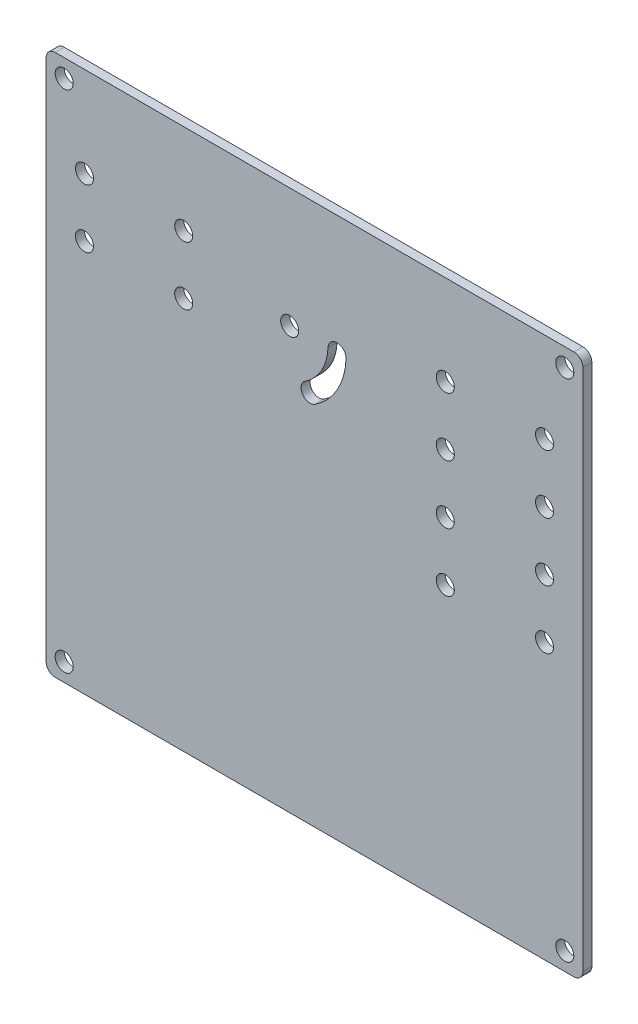
ISO-10303-21;
HEADER;
FILE_DESCRIPTION(('STEP AP214'),'2;1');
FILE_NAME('part.step','',(''),(''),'','','');
FILE_SCHEMA(('AUTOMOTIVE_DESIGN { 1 0 10303 214 1 1 1 1 }'));
ENDSEC;
DATA;
#1=APPLICATION_CONTEXT('core data for automotive mechanical design processes');
#2=APPLICATION_PROTOCOL_DEFINITION('international standard','automotive_design',2000,#1);
#3=PRODUCT_CONTEXT('',#1,'mechanical');
#4=PRODUCT('Part','Part','',(#3));
#5=PRODUCT_RELATED_PRODUCT_CATEGORY('part','',(#4));
#6=PRODUCT_DEFINITION_FORMATION('','',#4);
#7=PRODUCT_DEFINITION_CONTEXT('part definition',#1,'design');
#8=PRODUCT_DEFINITION('design','',#6,#7);
#9=PRODUCT_DEFINITION_SHAPE('','',#8);
#10=(LENGTH_UNIT() NAMED_UNIT(*) SI_UNIT(.MILLI.,.METRE.));
#11=(NAMED_UNIT(*) PLANE_ANGLE_UNIT() SI_UNIT($,.RADIAN.));
#12=(NAMED_UNIT(*) SI_UNIT($,.STERADIAN.) SOLID_ANGLE_UNIT());
#13=UNCERTAINTY_MEASURE_WITH_UNIT(LENGTH_MEASURE(1.E-05),#10,'distance_accuracy_value','');
#14=(GEOMETRIC_REPRESENTATION_CONTEXT(3) GLOBAL_UNCERTAINTY_ASSIGNED_CONTEXT((#13)) GLOBAL_UNIT_ASSIGNED_CONTEXT((#10,
#11,#12)) REPRESENTATION_CONTEXT('',''));
#15=CARTESIAN_POINT('',(0.,0.,0.));
#16=DIRECTION('',(0.,0.,1.));
#17=DIRECTION('',(1.,0.,0.));
#18=AXIS2_PLACEMENT_3D('',#15,#16,#17);
#19=CARTESIAN_POINT('',(0.,0.,2.));
#20=DIRECTION('',(0.,0.,-1.));
#21=DIRECTION('',(-1.,0.,0.));
#22=AXIS2_PLACEMENT_3D('',#19,#20,#21);
#23=PLANE('',#22);
#24=CARTESIAN_POINT('',(4.,116.,2.));
#25=DIRECTION('',(0.,0.,1.));
#26=DIRECTION('',(1.,0.,0.));
#27=AXIS2_PLACEMENT_3D('',#24,#25,#26);
#28=CIRCLE('',#27,2.);
#29=CARTESIAN_POINT('',(6.,116.,2.));
#30=VERTEX_POINT('',#29);
#31=EDGE_CURVE('E756',#30,#30,#28,.T.);
#32=ORIENTED_EDGE('',*,*,#31,.F.);
#33=EDGE_LOOP('',(#32));
#34=FACE_BOUND('',#33,.T.);
#35=CARTESIAN_POINT('',(115.,4.,2.));
#36=DIRECTION('',(0.,0.,1.));
#37=DIRECTION('',(1.,0.,0.));
#38=AXIS2_PLACEMENT_3D('',#35,#36,#37);
#39=CIRCLE('',#38,2.);
#40=CARTESIAN_POINT('',(117.,4.,2.));
#41=VERTEX_POINT('',#40);
#42=EDGE_CURVE('E760',#41,#41,#39,.T.);
#43=ORIENTED_EDGE('',*,*,#42,.F.);
#44=EDGE_LOOP('',(#43));
#45=FACE_BOUND('',#44,.T.);
#46=CARTESIAN_POINT('',(4.00000000000001,4.,2.));
#47=DIRECTION('',(0.,0.,1.));
#48=DIRECTION('',(1.,0.,0.));
#49=AXIS2_PLACEMENT_3D('',#46,#47,#48);
#50=CIRCLE('',#49,2.);
#51=CARTESIAN_POINT('',(6.00000000000001,4.,2.));
#52=VERTEX_POINT('',#51);
#53=EDGE_CURVE('E774',#52,#52,#50,.T.);
#54=ORIENTED_EDGE('',*,*,#53,.F.);
#55=EDGE_LOOP('',(#54));
#56=FACE_BOUND('',#55,.T.);
#57=CARTESIAN_POINT('',(115.,116.,2.));
#58=DIRECTION('',(0.,0.,1.));
#59=DIRECTION('',(1.,0.,0.));
#60=AXIS2_PLACEMENT_3D('',#57,#58,#59);
#61=CIRCLE('',#60,2.);
#62=CARTESIAN_POINT('',(117.,116.,2.));
#63=VERTEX_POINT('',#62);
#64=EDGE_CURVE('E766',#63,#63,#61,.T.);
#65=ORIENTED_EDGE('',*,*,#64,.F.);
#66=EDGE_LOOP('',(#65));
#67=FACE_BOUND('',#66,.T.);
#68=DIRECTION('',(0.,1.,0.));
#69=VECTOR('',#68,1.);
#70=CARTESIAN_POINT('',(119.,0.,2.));
#71=LINE('',#70,#69);
#72=CARTESIAN_POINT('',(119.,2.,2.));
#73=VERTEX_POINT('',#72);
#74=CARTESIAN_POINT('',(119.,118.,2.));
#75=VERTEX_POINT('',#74);
#76=EDGE_CURVE('E299',#73,#75,#71,.T.);
#77=ORIENTED_EDGE('',*,*,#76,.T.);
#78=CARTESIAN_POINT('',(117.,118.,2.));
#79=DIRECTION('',(0.,0.,-1.));
#80=DIRECTION('',(-1.,0.,0.));
#81=AXIS2_PLACEMENT_3D('',#78,#79,#80);
#82=CIRCLE('',#81,2.);
#83=CARTESIAN_POINT('',(117.,120.,2.));
#84=VERTEX_POINT('',#83);
#85=EDGE_CURVE('E353',#75,#84,#82,.F.);
#86=ORIENTED_EDGE('',*,*,#85,.T.);
#87=DIRECTION('',(1.,0.,0.));
#88=VECTOR('',#87,1.);
#89=CARTESIAN_POINT('',(0.,120.,2.));
#90=LINE('',#89,#88);
#91=CARTESIAN_POINT('',(2.,120.,2.));
#92=VERTEX_POINT('',#91);
#93=EDGE_CURVE('E294',#92,#84,#90,.T.);
#94=ORIENTED_EDGE('',*,*,#93,.F.);
#95=CARTESIAN_POINT('',(2.,118.,2.));
#96=DIRECTION('',(0.,0.,-1.));
#97=DIRECTION('',(-1.,0.,0.));
#98=AXIS2_PLACEMENT_3D('',#95,#96,#97);
#99=CIRCLE('',#98,2.);
#100=CARTESIAN_POINT('',(0.,118.,2.));
#101=VERTEX_POINT('',#100);
#102=EDGE_CURVE('E345',#92,#101,#99,.F.);
#103=ORIENTED_EDGE('',*,*,#102,.T.);
#104=DIRECTION('',(0.,1.,0.));
#105=VECTOR('',#104,1.);
#106=CARTESIAN_POINT('',(0.,0.,2.));
#107=LINE('',#106,#105);
#108=CARTESIAN_POINT('',(0.,2.,2.));
#109=VERTEX_POINT('',#108);
#110=EDGE_CURVE('E290',#109,#101,#107,.T.);
#111=ORIENTED_EDGE('',*,*,#110,.F.);
#112=CARTESIAN_POINT('',(2.,2.,2.));
#113=DIRECTION('',(0.,0.,-1.));
#114=DIRECTION('',(-1.,0.,0.));
#115=AXIS2_PLACEMENT_3D('',#112,#113,#114);
#116=CIRCLE('',#115,2.);
#117=CARTESIAN_POINT('',(2.,0.,2.));
#118=VERTEX_POINT('',#117);
#119=EDGE_CURVE('E62',#109,#118,#116,.F.);
#120=ORIENTED_EDGE('',*,*,#119,.T.);
#121=DIRECTION('',(1.,0.,0.));
#122=VECTOR('',#121,1.);
#123=CARTESIAN_POINT('',(0.,0.,2.));
#124=LINE('',#123,#122);
#125=CARTESIAN_POINT('',(117.,0.,2.));
#126=VERTEX_POINT('',#125);
#127=EDGE_CURVE('E303',#118,#126,#124,.T.);
#128=ORIENTED_EDGE('',*,*,#127,.T.);
#129=CARTESIAN_POINT('',(117.,2.,2.));
#130=DIRECTION('',(0.,0.,-1.));
#131=DIRECTION('',(-1.,0.,0.));
#132=AXIS2_PLACEMENT_3D('',#129,#130,#131);
#133=CIRCLE('',#132,2.);
#134=EDGE_CURVE('E350',#126,#73,#133,.F.);
#135=ORIENTED_EDGE('',*,*,#134,.T.);
#136=EDGE_LOOP('',(#77,#86,#94,#103,#111,#120,#128,#135));
#137=FACE_BOUND('',#136,.T.);
#138=CARTESIAN_POINT('',(8.5,100.,2.));
#139=DIRECTION('',(0.,0.,1.));
#140=DIRECTION('',(1.,0.,0.));
#141=AXIS2_PLACEMENT_3D('',#138,#139,#140);
#142=CIRCLE('',#141,2.);
#143=CARTESIAN_POINT('',(10.5,100.,2.));
#144=VERTEX_POINT('',#143);
#145=EDGE_CURVE('E282',#144,#144,#142,.T.);
#146=ORIENTED_EDGE('',*,*,#145,.F.);
#147=EDGE_LOOP('',(#146));
#148=FACE_BOUND('',#147,.T.);
#149=CARTESIAN_POINT('',(54.,93.5,2.));
#150=DIRECTION('',(0.,0.,1.));
#151=DIRECTION('',(1.,0.,0.));
#152=AXIS2_PLACEMENT_3D('',#149,#150,#151);
#153=CIRCLE('',#152,2.);
#154=CARTESIAN_POINT('',(56.,93.5,2.));
#155=VERTEX_POINT('',#154);
#156=EDGE_CURVE('E195',#155,#155,#153,.T.);
#157=ORIENTED_EDGE('',*,*,#156,.F.);
#158=EDGE_LOOP('',(#157));
#159=FACE_BOUND('',#158,.T.);
#160=CARTESIAN_POINT('',(30.5,87.,2.));
#161=DIRECTION('',(0.,0.,1.));
#162=DIRECTION('',(1.,0.,0.));
#163=AXIS2_PLACEMENT_3D('',#160,#161,#162);
#164=CIRCLE('',#163,2.);
#165=CARTESIAN_POINT('',(32.5,87.,2.));
#166=VERTEX_POINT('',#165);
#167=EDGE_CURVE('E186',#166,#166,#164,.T.);
#168=ORIENTED_EDGE('',*,*,#167,.F.);
#169=EDGE_LOOP('',(#168));
#170=FACE_BOUND('',#169,.T.);
#171=CARTESIAN_POINT('',(8.5,87.,2.));
#172=DIRECTION('',(0.,0.,1.));
#173=DIRECTION('',(1.,0.,0.));
#174=AXIS2_PLACEMENT_3D('',#171,#172,#173);
#175=CIRCLE('',#174,2.);
#176=CARTESIAN_POINT('',(10.5,87.,2.));
#177=VERTEX_POINT('',#176);
#178=EDGE_CURVE('E213',#177,#177,#175,.T.);
#179=ORIENTED_EDGE('',*,*,#178,.F.);
#180=EDGE_LOOP('',(#179));
#181=FACE_BOUND('',#180,.T.);
#182=CARTESIAN_POINT('',(30.5,100.,2.));
#183=DIRECTION('',(0.,0.,1.));
#184=DIRECTION('',(1.,0.,0.));
#185=AXIS2_PLACEMENT_3D('',#182,#183,#184);
#186=CIRCLE('',#185,2.);
#187=CARTESIAN_POINT('',(32.5,100.,2.));
#188=VERTEX_POINT('',#187);
#189=EDGE_CURVE('E204',#188,#188,#186,.T.);
#190=ORIENTED_EDGE('',*,*,#189,.F.);
#191=EDGE_LOOP('',(#190));
#192=FACE_BOUND('',#191,.T.);
#193=CARTESIAN_POINT('',(88.5,100.,2.));
#194=DIRECTION('',(0.,0.,1.));
#195=DIRECTION('',(1.,0.,0.));
#196=AXIS2_PLACEMENT_3D('',#193,#194,#195);
#197=CIRCLE('',#196,2.);
#198=CARTESIAN_POINT('',(90.5,100.,2.));
#199=VERTEX_POINT('',#198);
#200=EDGE_CURVE('E203',#199,#199,#197,.T.);
#201=ORIENTED_EDGE('',*,*,#200,.F.);
#202=EDGE_LOOP('',(#201));
#203=FACE_BOUND('',#202,.T.);
#204=CARTESIAN_POINT('',(88.5,87.,2.));
#205=DIRECTION('',(0.,0.,1.));
#206=DIRECTION('',(1.,0.,0.));
#207=AXIS2_PLACEMENT_3D('',#204,#205,#206);
#208=CIRCLE('',#207,2.);
#209=CARTESIAN_POINT('',(90.5,87.,2.));
#210=VERTEX_POINT('',#209);
#211=EDGE_CURVE('E227',#210,#210,#208,.T.);
#212=ORIENTED_EDGE('',*,*,#211,.F.);
#213=EDGE_LOOP('',(#212));
#214=FACE_BOUND('',#213,.T.);
#215=CARTESIAN_POINT('',(110.5,100.,2.));
#216=DIRECTION('',(0.,0.,1.));
#217=DIRECTION('',(1.,0.,0.));
#218=AXIS2_PLACEMENT_3D('',#215,#216,#217);
#219=CIRCLE('',#218,2.);
#220=CARTESIAN_POINT('',(112.5,100.,2.));
#221=VERTEX_POINT('',#220);
#222=EDGE_CURVE('E235',#221,#221,#219,.T.);
#223=ORIENTED_EDGE('',*,*,#222,.F.);
#224=EDGE_LOOP('',(#223));
#225=FACE_BOUND('',#224,.T.);
#226=CARTESIAN_POINT('',(110.5,87.,2.));
#227=DIRECTION('',(0.,0.,1.));
#228=DIRECTION('',(1.,0.,0.));
#229=AXIS2_PLACEMENT_3D('',#226,#227,#228);
#230=CIRCLE('',#229,2.);
#231=CARTESIAN_POINT('',(112.5,87.,2.));
#232=VERTEX_POINT('',#231);
#233=EDGE_CURVE('E243',#232,#232,#230,.T.);
#234=ORIENTED_EDGE('',*,*,#233,.F.);
#235=EDGE_LOOP('',(#234));
#236=FACE_BOUND('',#235,.T.);
#237=CARTESIAN_POINT('',(88.5,74.,2.));
#238=DIRECTION('',(0.,0.,1.));
#239=DIRECTION('',(1.,0.,0.));
#240=AXIS2_PLACEMENT_3D('',#237,#238,#239);
#241=CIRCLE('',#240,2.);
#242=CARTESIAN_POINT('',(90.5,74.,2.));
#243=VERTEX_POINT('',#242);
#244=EDGE_CURVE('E251',#243,#243,#241,.T.);
#245=ORIENTED_EDGE('',*,*,#244,.F.);
#246=EDGE_LOOP('',(#245));
#247=FACE_BOUND('',#246,.T.);
#248=CARTESIAN_POINT('',(88.5,61.,2.));
#249=DIRECTION('',(0.,0.,1.));
#250=DIRECTION('',(1.,0.,0.));
#251=AXIS2_PLACEMENT_3D('',#248,#249,#250);
#252=CIRCLE('',#251,2.);
#253=CARTESIAN_POINT('',(90.5,61.,2.));
#254=VERTEX_POINT('',#253);
#255=EDGE_CURVE('E259',#254,#254,#252,.T.);
#256=ORIENTED_EDGE('',*,*,#255,.F.);
#257=EDGE_LOOP('',(#256));
#258=FACE_BOUND('',#257,.T.);
#259=CARTESIAN_POINT('',(110.5,74.,2.));
#260=DIRECTION('',(0.,0.,1.));
#261=DIRECTION('',(1.,0.,0.));
#262=AXIS2_PLACEMENT_3D('',#259,#260,#261);
#263=CIRCLE('',#262,2.);
#264=CARTESIAN_POINT('',(112.5,74.,2.));
#265=VERTEX_POINT('',#264);
#266=EDGE_CURVE('E267',#265,#265,#263,.T.);
#267=ORIENTED_EDGE('',*,*,#266,.F.);
#268=EDGE_LOOP('',(#267));
#269=FACE_BOUND('',#268,.T.);
#270=CARTESIAN_POINT('',(110.5,61.,2.));
#271=DIRECTION('',(0.,0.,1.));
#272=DIRECTION('',(1.,0.,0.));
#273=AXIS2_PLACEMENT_3D('',#270,#271,#272);
#274=CIRCLE('',#273,2.);
#275=CARTESIAN_POINT('',(112.5,61.,2.));
#276=VERTEX_POINT('',#275);
#277=EDGE_CURVE('E275',#276,#276,#274,.T.);
#278=ORIENTED_EDGE('',*,*,#277,.F.);
#279=EDGE_LOOP('',(#278));
#280=FACE_BOUND('',#279,.T.);
#281=CARTESIAN_POINT('',(58.5211331715895,82.905441538271,2.));
#282=DIRECTION('',(0.,0.,1.));
#283=DIRECTION('',(1.,0.,0.));
#284=AXIS2_PLACEMENT_3D('',#281,#282,#283);
#285=CIRCLE('',#284,2.);
#286=CARTESIAN_POINT('',(57.4241250793313,84.5777373391149,2.));
#287=VERTEX_POINT('',#286);
#288=CARTESIAN_POINT('',(59.6181412638477,81.2331457374271,2.));
#289=VERTEX_POINT('',#288);
#290=EDGE_CURVE('E131',#287,#289,#285,.T.);
#291=ORIENTED_EDGE('',*,*,#290,.F.);
#292=CARTESIAN_POINT('',(51.2464197735433,93.9951251547819,2.));
#293=DIRECTION('',(0.,0.,-1.));
#294=DIRECTION('',(1.,0.,0.));
#295=AXIS2_PLACEMENT_3D('',#292,#293,#294);
#296=CIRCLE('',#295,11.262825405547);
#297=CARTESIAN_POINT('',(62.5013941492567,93.5746636014035,2.));
#298=VERTEX_POINT('',#297);
#299=EDGE_CURVE('E160',#298,#287,#296,.T.);
#300=ORIENTED_EDGE('',*,*,#299,.F.);
#301=CARTESIAN_POINT('',(64.5,93.5,2.));
#302=DIRECTION('',(0.,0.,1.));
#303=DIRECTION('',(-1.,0.,0.));
#304=AXIS2_PLACEMENT_3D('',#301,#302,#303);
#305=CIRCLE('',#304,2.);
#306=CARTESIAN_POINT('',(66.4986058507433,93.4253363985965,2.));
#307=VERTEX_POINT('',#306);
#308=EDGE_CURVE('E156',#307,#298,#305,.T.);
#309=ORIENTED_EDGE('',*,*,#308,.F.);
#310=CARTESIAN_POINT('',(51.2464197735433,93.9951251547819,2.));
#311=DIRECTION('',(0.,0.,1.));
#312=DIRECTION('',(1.,0.,0.));
#313=AXIS2_PLACEMENT_3D('',#310,#311,#312);
#314=CIRCLE('',#313,15.262825405547);
#315=EDGE_CURVE('E142',#289,#307,#314,.T.);
#316=ORIENTED_EDGE('',*,*,#315,.F.);
#317=EDGE_LOOP('',(#291,#300,#309,#316));
#318=FACE_BOUND('',#317,.T.);
#319=ADVANCED_FACE('F39',(#34,#45,#56,#67,#137,#148,#159,#170,#181,#192,#203,#214,#225,#236,
#247,#258,#269,#280,#318),#23,.F.);
#320=CARTESIAN_POINT('',(0.,0.,0.));
#321=DIRECTION('',(0.,0.,-1.));
#322=DIRECTION('',(-1.,0.,0.));
#323=AXIS2_PLACEMENT_3D('',#320,#321,#322);
#324=PLANE('',#323);
#325=CARTESIAN_POINT('',(4.,116.,0.));
#326=DIRECTION('',(0.,0.,1.));
#327=DIRECTION('',(1.,0.,0.));
#328=AXIS2_PLACEMENT_3D('',#325,#326,#327);
#329=CIRCLE('',#328,2.);
#330=CARTESIAN_POINT('',(6.,116.,0.));
#331=VERTEX_POINT('',#330);
#332=EDGE_CURVE('E754',#331,#331,#329,.T.);
#333=ORIENTED_EDGE('',*,*,#332,.T.);
#334=EDGE_LOOP('',(#333));
#335=FACE_BOUND('',#334,.T.);
#336=CARTESIAN_POINT('',(115.,4.,0.));
#337=DIRECTION('',(0.,0.,1.));
#338=DIRECTION('',(1.,0.,0.));
#339=AXIS2_PLACEMENT_3D('',#336,#337,#338);
#340=CIRCLE('',#339,2.);
#341=CARTESIAN_POINT('',(117.,4.,0.));
#342=VERTEX_POINT('',#341);
#343=EDGE_CURVE('E780',#342,#342,#340,.T.);
#344=ORIENTED_EDGE('',*,*,#343,.T.);
#345=EDGE_LOOP('',(#344));
#346=FACE_BOUND('',#345,.T.);
#347=CARTESIAN_POINT('',(4.00000000000001,4.,0.));
#348=DIRECTION('',(0.,0.,1.));
#349=DIRECTION('',(1.,0.,0.));
#350=AXIS2_PLACEMENT_3D('',#347,#348,#349);
#351=CIRCLE('',#350,2.);
#352=CARTESIAN_POINT('',(6.00000000000001,4.,0.));
#353=VERTEX_POINT('',#352);
#354=EDGE_CURVE('E769',#353,#353,#351,.T.);
#355=ORIENTED_EDGE('',*,*,#354,.T.);
#356=EDGE_LOOP('',(#355));
#357=FACE_BOUND('',#356,.T.);
#358=CARTESIAN_POINT('',(115.,116.,0.));
#359=DIRECTION('',(0.,0.,1.));
#360=DIRECTION('',(1.,0.,0.));
#361=AXIS2_PLACEMENT_3D('',#358,#359,#360);
#362=CIRCLE('',#361,2.);
#363=CARTESIAN_POINT('',(117.,116.,0.));
#364=VERTEX_POINT('',#363);
#365=EDGE_CURVE('E169',#364,#364,#362,.T.);
#366=ORIENTED_EDGE('',*,*,#365,.T.);
#367=EDGE_LOOP('',(#366));
#368=FACE_BOUND('',#367,.T.);
#369=CARTESIAN_POINT('',(110.5,61.,0.));
#370=DIRECTION('',(0.,0.,1.));
#371=DIRECTION('',(1.,0.,0.));
#372=AXIS2_PLACEMENT_3D('',#369,#370,#371);
#373=CIRCLE('',#372,2.);
#374=CARTESIAN_POINT('',(112.5,61.,0.));
#375=VERTEX_POINT('',#374);
#376=EDGE_CURVE('E151',#375,#375,#373,.T.);
#377=ORIENTED_EDGE('',*,*,#376,.T.);
#378=EDGE_LOOP('',(#377));
#379=FACE_BOUND('',#378,.T.);
#380=CARTESIAN_POINT('',(110.5,74.,0.));
#381=DIRECTION('',(0.,0.,1.));
#382=DIRECTION('',(1.,0.,0.));
#383=AXIS2_PLACEMENT_3D('',#380,#381,#382);
#384=CIRCLE('',#383,2.);
#385=CARTESIAN_POINT('',(112.5,74.,0.));
#386=VERTEX_POINT('',#385);
#387=EDGE_CURVE('E271',#386,#386,#384,.T.);
#388=ORIENTED_EDGE('',*,*,#387,.T.);
#389=EDGE_LOOP('',(#388));
#390=FACE_BOUND('',#389,.T.);
#391=CARTESIAN_POINT('',(88.5,61.,0.));
#392=DIRECTION('',(0.,0.,1.));
#393=DIRECTION('',(1.,0.,0.));
#394=AXIS2_PLACEMENT_3D('',#391,#392,#393);
#395=CIRCLE('',#394,2.);
#396=CARTESIAN_POINT('',(90.5,61.,0.));
#397=VERTEX_POINT('',#396);
#398=EDGE_CURVE('E263',#397,#397,#395,.T.);
#399=ORIENTED_EDGE('',*,*,#398,.T.);
#400=EDGE_LOOP('',(#399));
#401=FACE_BOUND('',#400,.T.);
#402=CARTESIAN_POINT('',(88.5,74.,0.));
#403=DIRECTION('',(0.,0.,1.));
#404=DIRECTION('',(1.,0.,0.));
#405=AXIS2_PLACEMENT_3D('',#402,#403,#404);
#406=CIRCLE('',#405,2.);
#407=CARTESIAN_POINT('',(90.5,74.,0.));
#408=VERTEX_POINT('',#407);
#409=EDGE_CURVE('E255',#408,#408,#406,.T.);
#410=ORIENTED_EDGE('',*,*,#409,.T.);
#411=EDGE_LOOP('',(#410));
#412=FACE_BOUND('',#411,.T.);
#413=CARTESIAN_POINT('',(110.5,87.,0.));
#414=DIRECTION('',(0.,0.,1.));
#415=DIRECTION('',(1.,0.,0.));
#416=AXIS2_PLACEMENT_3D('',#413,#414,#415);
#417=CIRCLE('',#416,2.);
#418=CARTESIAN_POINT('',(112.5,87.,0.));
#419=VERTEX_POINT('',#418);
#420=EDGE_CURVE('E247',#419,#419,#417,.T.);
#421=ORIENTED_EDGE('',*,*,#420,.T.);
#422=EDGE_LOOP('',(#421));
#423=FACE_BOUND('',#422,.T.);
#424=CARTESIAN_POINT('',(110.5,100.,0.));
#425=DIRECTION('',(0.,0.,1.));
#426=DIRECTION('',(1.,0.,0.));
#427=AXIS2_PLACEMENT_3D('',#424,#425,#426);
#428=CIRCLE('',#427,2.);
#429=CARTESIAN_POINT('',(112.5,100.,0.));
#430=VERTEX_POINT('',#429);
#431=EDGE_CURVE('E239',#430,#430,#428,.T.);
#432=ORIENTED_EDGE('',*,*,#431,.T.);
#433=EDGE_LOOP('',(#432));
#434=FACE_BOUND('',#433,.T.);
#435=CARTESIAN_POINT('',(88.5,87.,0.));
#436=DIRECTION('',(0.,0.,1.));
#437=DIRECTION('',(1.,0.,0.));
#438=AXIS2_PLACEMENT_3D('',#435,#436,#437);
#439=CIRCLE('',#438,2.);
#440=CARTESIAN_POINT('',(90.5,87.,0.));
#441=VERTEX_POINT('',#440);
#442=EDGE_CURVE('E231',#441,#441,#439,.T.);
#443=ORIENTED_EDGE('',*,*,#442,.T.);
#444=EDGE_LOOP('',(#443));
#445=FACE_BOUND('',#444,.T.);
#446=CARTESIAN_POINT('',(88.5,100.,0.));
#447=DIRECTION('',(0.,0.,1.));
#448=DIRECTION('',(1.,0.,0.));
#449=AXIS2_PLACEMENT_3D('',#446,#447,#448);
#450=CIRCLE('',#449,2.);
#451=CARTESIAN_POINT('',(90.5,100.,0.));
#452=VERTEX_POINT('',#451);
#453=EDGE_CURVE('E223',#452,#452,#450,.T.);
#454=ORIENTED_EDGE('',*,*,#453,.T.);
#455=EDGE_LOOP('',(#454));
#456=FACE_BOUND('',#455,.T.);
#457=CARTESIAN_POINT('',(30.5,100.,0.));
#458=DIRECTION('',(0.,0.,1.));
#459=DIRECTION('',(1.,0.,0.));
#460=AXIS2_PLACEMENT_3D('',#457,#458,#459);
#461=CIRCLE('',#460,2.);
#462=CARTESIAN_POINT('',(32.5,100.,0.));
#463=VERTEX_POINT('',#462);
#464=EDGE_CURVE('E209',#463,#463,#461,.T.);
#465=ORIENTED_EDGE('',*,*,#464,.T.);
#466=EDGE_LOOP('',(#465));
#467=FACE_BOUND('',#466,.T.);
#468=CARTESIAN_POINT('',(8.5,87.,0.));
#469=DIRECTION('',(0.,0.,1.));
#470=DIRECTION('',(1.,0.,0.));
#471=AXIS2_PLACEMENT_3D('',#468,#469,#470);
#472=CIRCLE('',#471,2.);
#473=CARTESIAN_POINT('',(10.5,87.,0.));
#474=VERTEX_POINT('',#473);
#475=EDGE_CURVE('E190',#474,#474,#472,.T.);
#476=ORIENTED_EDGE('',*,*,#475,.T.);
#477=EDGE_LOOP('',(#476));
#478=FACE_BOUND('',#477,.T.);
#479=CARTESIAN_POINT('',(30.5,87.,0.));
#480=DIRECTION('',(0.,0.,1.));
#481=DIRECTION('',(1.,0.,0.));
#482=AXIS2_PLACEMENT_3D('',#479,#480,#481);
#483=CIRCLE('',#482,2.);
#484=CARTESIAN_POINT('',(32.5,87.,0.));
#485=VERTEX_POINT('',#484);
#486=EDGE_CURVE('E191',#485,#485,#483,.T.);
#487=ORIENTED_EDGE('',*,*,#486,.T.);
#488=EDGE_LOOP('',(#487));
#489=FACE_BOUND('',#488,.T.);
#490=CARTESIAN_POINT('',(54.,93.5,0.));
#491=DIRECTION('',(0.,0.,1.));
#492=DIRECTION('',(1.,0.,0.));
#493=AXIS2_PLACEMENT_3D('',#490,#491,#492);
#494=CIRCLE('',#493,2.);
#495=CARTESIAN_POINT('',(56.,93.5,0.));
#496=VERTEX_POINT('',#495);
#497=EDGE_CURVE('E199',#496,#496,#494,.T.);
#498=ORIENTED_EDGE('',*,*,#497,.T.);
#499=EDGE_LOOP('',(#498));
#500=FACE_BOUND('',#499,.T.);
#501=CARTESIAN_POINT('',(8.5,100.,0.));
#502=DIRECTION('',(0.,0.,1.));
#503=DIRECTION('',(1.,0.,0.));
#504=AXIS2_PLACEMENT_3D('',#501,#502,#503);
#505=CIRCLE('',#504,2.);
#506=CARTESIAN_POINT('',(10.5,100.,0.));
#507=VERTEX_POINT('',#506);
#508=EDGE_CURVE('E208',#507,#507,#505,.T.);
#509=ORIENTED_EDGE('',*,*,#508,.T.);
#510=EDGE_LOOP('',(#509));
#511=FACE_BOUND('',#510,.T.);
#512=DIRECTION('',(1.,0.,0.));
#513=VECTOR('',#512,1.);
#514=CARTESIAN_POINT('',(0.,120.,0.));
#515=LINE('',#514,#513);
#516=CARTESIAN_POINT('',(2.,120.,0.));
#517=VERTEX_POINT('',#516);
#518=CARTESIAN_POINT('',(117.,120.,0.));
#519=VERTEX_POINT('',#518);
#520=EDGE_CURVE('E310',#517,#519,#515,.T.);
#521=ORIENTED_EDGE('',*,*,#520,.T.);
#522=CARTESIAN_POINT('',(117.,118.,0.));
#523=DIRECTION('',(0.,0.,-1.));
#524=DIRECTION('',(-1.,0.,0.));
#525=AXIS2_PLACEMENT_3D('',#522,#523,#524);
#526=CIRCLE('',#525,2.);
#527=CARTESIAN_POINT('',(119.,118.,0.));
#528=VERTEX_POINT('',#527);
#529=EDGE_CURVE('E335',#519,#528,#526,.T.);
#530=ORIENTED_EDGE('',*,*,#529,.T.);
#531=DIRECTION('',(0.,1.,0.));
#532=VECTOR('',#531,1.);
#533=CARTESIAN_POINT('',(119.,0.,0.));
#534=LINE('',#533,#532);
#535=CARTESIAN_POINT('',(119.,2.,0.));
#536=VERTEX_POINT('',#535);
#537=EDGE_CURVE('E314',#536,#528,#534,.T.);
#538=ORIENTED_EDGE('',*,*,#537,.F.);
#539=CARTESIAN_POINT('',(117.,2.,0.));
#540=DIRECTION('',(0.,0.,-1.));
#541=DIRECTION('',(-1.,0.,0.));
#542=AXIS2_PLACEMENT_3D('',#539,#540,#541);
#543=CIRCLE('',#542,2.);
#544=CARTESIAN_POINT('',(117.,0.,0.));
#545=VERTEX_POINT('',#544);
#546=EDGE_CURVE('E332',#536,#545,#543,.T.);
#547=ORIENTED_EDGE('',*,*,#546,.T.);
#548=DIRECTION('',(1.,0.,0.));
#549=VECTOR('',#548,1.);
#550=CARTESIAN_POINT('',(0.,0.,0.));
#551=LINE('',#550,#549);
#552=CARTESIAN_POINT('',(2.,0.,0.));
#553=VERTEX_POINT('',#552);
#554=EDGE_CURVE('E295',#553,#545,#551,.T.);
#555=ORIENTED_EDGE('',*,*,#554,.F.);
#556=CARTESIAN_POINT('',(2.,2.,0.));
#557=DIRECTION('',(0.,0.,-1.));
#558=DIRECTION('',(-1.,0.,0.));
#559=AXIS2_PLACEMENT_3D('',#556,#557,#558);
#560=CIRCLE('',#559,2.);
#561=CARTESIAN_POINT('',(0.,2.,0.));
#562=VERTEX_POINT('',#561);
#563=EDGE_CURVE('E329',#553,#562,#560,.T.);
#564=ORIENTED_EDGE('',*,*,#563,.T.);
#565=DIRECTION('',(0.,1.,0.));
#566=VECTOR('',#565,1.);
#567=CARTESIAN_POINT('',(0.,0.,0.));
#568=LINE('',#567,#566);
#569=CARTESIAN_POINT('',(0.,118.,0.));
#570=VERTEX_POINT('',#569);
#571=EDGE_CURVE('E286',#562,#570,#568,.T.);
#572=ORIENTED_EDGE('',*,*,#571,.T.);
#573=CARTESIAN_POINT('',(2.,118.,0.));
#574=DIRECTION('',(0.,0.,-1.));
#575=DIRECTION('',(-1.,0.,0.));
#576=AXIS2_PLACEMENT_3D('',#573,#574,#575);
#577=CIRCLE('',#576,2.);
#578=EDGE_CURVE('E326',#570,#517,#577,.T.);
#579=ORIENTED_EDGE('',*,*,#578,.T.);
#580=EDGE_LOOP('',(#521,#530,#538,#547,#555,#564,#572,#579));
#581=FACE_BOUND('',#580,.T.);
#582=CARTESIAN_POINT('',(51.2464197735433,93.9951251547819,0.));
#583=DIRECTION('',(0.,0.,-1.));
#584=DIRECTION('',(1.,0.,0.));
#585=AXIS2_PLACEMENT_3D('',#582,#583,#584);
#586=CIRCLE('',#585,11.262825405547);
#587=CARTESIAN_POINT('',(62.5013941492567,93.5746636014035,0.));
#588=VERTEX_POINT('',#587);
#589=CARTESIAN_POINT('',(57.4241250793313,84.5777373391149,0.));
#590=VERTEX_POINT('',#589);
#591=EDGE_CURVE('E143',#588,#590,#586,.T.);
#592=ORIENTED_EDGE('',*,*,#591,.T.);
#593=CARTESIAN_POINT('',(58.5211331715895,82.905441538271,0.));
#594=DIRECTION('',(0.,0.,1.));
#595=DIRECTION('',(1.,0.,0.));
#596=AXIS2_PLACEMENT_3D('',#593,#594,#595);
#597=CIRCLE('',#596,2.);
#598=CARTESIAN_POINT('',(59.6181412638477,81.2331457374271,0.));
#599=VERTEX_POINT('',#598);
#600=EDGE_CURVE('E166',#590,#599,#597,.T.);
#601=ORIENTED_EDGE('',*,*,#600,.T.);
#602=CARTESIAN_POINT('',(51.2464197735433,93.9951251547819,0.));
#603=DIRECTION('',(0.,0.,1.));
#604=DIRECTION('',(1.,0.,0.));
#605=AXIS2_PLACEMENT_3D('',#602,#603,#604);
#606=CIRCLE('',#605,15.262825405547);
#607=CARTESIAN_POINT('',(66.4986058507433,93.4253363985965,0.));
#608=VERTEX_POINT('',#607);
#609=EDGE_CURVE('E149',#599,#608,#606,.T.);
#610=ORIENTED_EDGE('',*,*,#609,.T.);
#611=CARTESIAN_POINT('',(64.5,93.5,0.));
#612=DIRECTION('',(0.,0.,1.));
#613=DIRECTION('',(-1.,0.,0.));
#614=AXIS2_PLACEMENT_3D('',#611,#612,#613);
#615=CIRCLE('',#614,2.);
#616=EDGE_CURVE('E172',#608,#588,#615,.T.);
#617=ORIENTED_EDGE('',*,*,#616,.T.);
#618=EDGE_LOOP('',(#592,#601,#610,#617));
#619=FACE_BOUND('',#618,.T.);
#620=ADVANCED_FACE('F371',(#335,#346,#357,#368,#379,#390,#401,#412,#423,#434,#445,#456,#467,
#478,#489,#500,#511,#581,#619),#324,.T.);
#621=CARTESIAN_POINT('',(0.,0.,2.));
#622=DIRECTION('',(-1.,0.,0.));
#623=DIRECTION('',(0.,0.,1.));
#624=AXIS2_PLACEMENT_3D('',#621,#622,#623);
#625=PLANE('',#624);
#626=ORIENTED_EDGE('',*,*,#571,.F.);
#627=DIRECTION('',(0.,0.,-1.));
#628=VECTOR('',#627,1.);
#629=CARTESIAN_POINT('',(0.,2.,2.));
#630=LINE('',#629,#628);
#631=EDGE_CURVE('E11',#562,#109,#630,.F.);
#632=ORIENTED_EDGE('',*,*,#631,.T.);
#633=ORIENTED_EDGE('',*,*,#110,.T.);
#634=DIRECTION('',(0.,0.,-1.));
#635=VECTOR('',#634,1.);
#636=CARTESIAN_POINT('',(0.,118.,2.));
#637=LINE('',#636,#635);
#638=EDGE_CURVE('E48',#101,#570,#637,.T.);
#639=ORIENTED_EDGE('',*,*,#638,.T.);
#640=EDGE_LOOP('',(#626,#632,#633,#639));
#641=FACE_BOUND('',#640,.T.);
#642=ADVANCED_FACE('F366',(#641),#625,.T.);
#643=CARTESIAN_POINT('',(0.,0.,2.));
#644=DIRECTION('',(0.,1.,0.));
#645=DIRECTION('',(0.,0.,1.));
#646=AXIS2_PLACEMENT_3D('',#643,#644,#645);
#647=PLANE('',#646);
#648=ORIENTED_EDGE('',*,*,#554,.T.);
#649=DIRECTION('',(0.,0.,-1.));
#650=VECTOR('',#649,1.);
#651=CARTESIAN_POINT('',(117.,0.,2.));
#652=LINE('',#651,#650);
#653=EDGE_CURVE('E55',#545,#126,#652,.F.);
#654=ORIENTED_EDGE('',*,*,#653,.T.);
#655=ORIENTED_EDGE('',*,*,#127,.F.);
#656=DIRECTION('',(0.,0.,-1.));
#657=VECTOR('',#656,1.);
#658=CARTESIAN_POINT('',(2.,0.,0.));
#659=LINE('',#658,#657);
#660=EDGE_CURVE('E356',#118,#553,#659,.T.);
#661=ORIENTED_EDGE('',*,*,#660,.T.);
#662=EDGE_LOOP('',(#648,#654,#655,#661));
#663=FACE_BOUND('',#662,.T.);
#664=ADVANCED_FACE('F378',(#663),#647,.F.);
#665=CARTESIAN_POINT('',(119.,0.,2.));
#666=DIRECTION('',(-1.,0.,0.));
#667=DIRECTION('',(0.,0.,1.));
#668=AXIS2_PLACEMENT_3D('',#665,#666,#667);
#669=PLANE('',#668);
#670=ORIENTED_EDGE('',*,*,#537,.T.);
#671=DIRECTION('',(0.,0.,-1.));
#672=VECTOR('',#671,1.);
#673=CARTESIAN_POINT('',(119.,118.,2.));
#674=LINE('',#673,#672);
#675=EDGE_CURVE('E342',#528,#75,#674,.F.);
#676=ORIENTED_EDGE('',*,*,#675,.T.);
#677=ORIENTED_EDGE('',*,*,#76,.F.);
#678=DIRECTION('',(0.,0.,-1.));
#679=VECTOR('',#678,1.);
#680=CARTESIAN_POINT('',(119.,2.,2.));
#681=LINE('',#680,#679);
#682=EDGE_CURVE('E338',#73,#536,#681,.T.);
#683=ORIENTED_EDGE('',*,*,#682,.T.);
#684=EDGE_LOOP('',(#670,#676,#677,#683));
#685=FACE_BOUND('',#684,.T.);
#686=ADVANCED_FACE('F387',(#685),#669,.F.);
#687=CARTESIAN_POINT('',(0.,120.,2.));
#688=DIRECTION('',(0.,1.,0.));
#689=DIRECTION('',(0.,0.,1.));
#690=AXIS2_PLACEMENT_3D('',#687,#688,#689);
#691=PLANE('',#690);
#692=ORIENTED_EDGE('',*,*,#93,.T.);
#693=DIRECTION('',(0.,0.,-1.));
#694=VECTOR('',#693,1.);
#695=CARTESIAN_POINT('',(117.,120.,0.));
#696=LINE('',#695,#694);
#697=EDGE_CURVE('E322',#84,#519,#696,.T.);
#698=ORIENTED_EDGE('',*,*,#697,.T.);
#699=ORIENTED_EDGE('',*,*,#520,.F.);
#700=DIRECTION('',(0.,0.,-1.));
#701=VECTOR('',#700,1.);
#702=CARTESIAN_POINT('',(2.,120.,2.));
#703=LINE('',#702,#701);
#704=EDGE_CURVE('E306',#517,#92,#703,.F.);
#705=ORIENTED_EDGE('',*,*,#704,.T.);
#706=EDGE_LOOP('',(#692,#698,#699,#705));
#707=FACE_BOUND('',#706,.T.);
#708=ADVANCED_FACE('F394',(#707),#691,.T.);
#709=CARTESIAN_POINT('',(8.5,100.,2.));
#710=DIRECTION('',(0.,0.,-1.));
#711=DIRECTION('',(-1.,0.,0.));
#712=AXIS2_PLACEMENT_3D('',#709,#710,#711);
#713=CYLINDRICAL_SURFACE('',#712,2.);
#714=ORIENTED_EDGE('',*,*,#145,.T.);
#715=EDGE_LOOP('',(#714));
#716=FACE_BOUND('',#715,.T.);
#717=ORIENTED_EDGE('',*,*,#508,.F.);
#718=EDGE_LOOP('',(#717));
#719=FACE_BOUND('',#718,.T.);
#720=ADVANCED_FACE('F417',(#716,#719),#713,.F.);
#721=CARTESIAN_POINT('',(54.,93.5,2.));
#722=DIRECTION('',(0.,0.,-1.));
#723=DIRECTION('',(-1.,0.,0.));
#724=AXIS2_PLACEMENT_3D('',#721,#722,#723);
#725=CYLINDRICAL_SURFACE('',#724,2.);
#726=ORIENTED_EDGE('',*,*,#156,.T.);
#727=EDGE_LOOP('',(#726));
#728=FACE_BOUND('',#727,.T.);
#729=ORIENTED_EDGE('',*,*,#497,.F.);
#730=EDGE_LOOP('',(#729));
#731=FACE_BOUND('',#730,.T.);
#732=ADVANCED_FACE('F514',(#728,#731),#725,.F.);
#733=CARTESIAN_POINT('',(30.5,87.,2.));
#734=DIRECTION('',(0.,0.,-1.));
#735=DIRECTION('',(-1.,0.,0.));
#736=AXIS2_PLACEMENT_3D('',#733,#734,#735);
#737=CYLINDRICAL_SURFACE('',#736,2.);
#738=ORIENTED_EDGE('',*,*,#167,.T.);
#739=EDGE_LOOP('',(#738));
#740=FACE_BOUND('',#739,.T.);
#741=ORIENTED_EDGE('',*,*,#486,.F.);
#742=EDGE_LOOP('',(#741));
#743=FACE_BOUND('',#742,.T.);
#744=ADVANCED_FACE('F510',(#740,#743),#737,.F.);
#745=CARTESIAN_POINT('',(8.5,87.,2.));
#746=DIRECTION('',(0.,0.,-1.));
#747=DIRECTION('',(-1.,0.,0.));
#748=AXIS2_PLACEMENT_3D('',#745,#746,#747);
#749=CYLINDRICAL_SURFACE('',#748,2.);
#750=ORIENTED_EDGE('',*,*,#178,.T.);
#751=EDGE_LOOP('',(#750));
#752=FACE_BOUND('',#751,.T.);
#753=ORIENTED_EDGE('',*,*,#475,.F.);
#754=EDGE_LOOP('',(#753));
#755=FACE_BOUND('',#754,.T.);
#756=ADVANCED_FACE('F513',(#752,#755),#749,.F.);
#757=CARTESIAN_POINT('',(30.5,100.,2.));
#758=DIRECTION('',(0.,0.,-1.));
#759=DIRECTION('',(-1.,0.,0.));
#760=AXIS2_PLACEMENT_3D('',#757,#758,#759);
#761=CYLINDRICAL_SURFACE('',#760,2.);
#762=ORIENTED_EDGE('',*,*,#189,.T.);
#763=EDGE_LOOP('',(#762));
#764=FACE_BOUND('',#763,.T.);
#765=ORIENTED_EDGE('',*,*,#464,.F.);
#766=EDGE_LOOP('',(#765));
#767=FACE_BOUND('',#766,.T.);
#768=ADVANCED_FACE('F519',(#764,#767),#761,.F.);
#769=CARTESIAN_POINT('',(88.5,100.,2.));
#770=DIRECTION('',(0.,0.,-1.));
#771=DIRECTION('',(-1.,0.,0.));
#772=AXIS2_PLACEMENT_3D('',#769,#770,#771);
#773=CYLINDRICAL_SURFACE('',#772,2.);
#774=ORIENTED_EDGE('',*,*,#200,.T.);
#775=EDGE_LOOP('',(#774));
#776=FACE_BOUND('',#775,.T.);
#777=ORIENTED_EDGE('',*,*,#453,.F.);
#778=EDGE_LOOP('',(#777));
#779=FACE_BOUND('',#778,.T.);
#780=ADVANCED_FACE('F522',(#776,#779),#773,.F.);
#781=CARTESIAN_POINT('',(88.5,87.,2.));
#782=DIRECTION('',(0.,0.,-1.));
#783=DIRECTION('',(-1.,0.,0.));
#784=AXIS2_PLACEMENT_3D('',#781,#782,#783);
#785=CYLINDRICAL_SURFACE('',#784,2.);
#786=ORIENTED_EDGE('',*,*,#211,.T.);
#787=EDGE_LOOP('',(#786));
#788=FACE_BOUND('',#787,.T.);
#789=ORIENTED_EDGE('',*,*,#442,.F.);
#790=EDGE_LOOP('',(#789));
#791=FACE_BOUND('',#790,.T.);
#792=ADVANCED_FACE('F529',(#788,#791),#785,.F.);
#793=CARTESIAN_POINT('',(110.5,100.,2.));
#794=DIRECTION('',(0.,0.,-1.));
#795=DIRECTION('',(-1.,0.,0.));
#796=AXIS2_PLACEMENT_3D('',#793,#794,#795);
#797=CYLINDRICAL_SURFACE('',#796,2.);
#798=ORIENTED_EDGE('',*,*,#222,.T.);
#799=EDGE_LOOP('',(#798));
#800=FACE_BOUND('',#799,.T.);
#801=ORIENTED_EDGE('',*,*,#431,.F.);
#802=EDGE_LOOP('',(#801));
#803=FACE_BOUND('',#802,.T.);
#804=ADVANCED_FACE('F533',(#800,#803),#797,.F.);
#805=CARTESIAN_POINT('',(110.5,87.,2.));
#806=DIRECTION('',(0.,0.,-1.));
#807=DIRECTION('',(-1.,0.,0.));
#808=AXIS2_PLACEMENT_3D('',#805,#806,#807);
#809=CYLINDRICAL_SURFACE('',#808,2.);
#810=ORIENTED_EDGE('',*,*,#233,.T.);
#811=EDGE_LOOP('',(#810));
#812=FACE_BOUND('',#811,.T.);
#813=ORIENTED_EDGE('',*,*,#420,.F.);
#814=EDGE_LOOP('',(#813));
#815=FACE_BOUND('',#814,.T.);
#816=ADVANCED_FACE('F537',(#812,#815),#809,.F.);
#817=CARTESIAN_POINT('',(88.5,74.,2.));
#818=DIRECTION('',(0.,0.,-1.));
#819=DIRECTION('',(-1.,0.,0.));
#820=AXIS2_PLACEMENT_3D('',#817,#818,#819);
#821=CYLINDRICAL_SURFACE('',#820,2.);
#822=ORIENTED_EDGE('',*,*,#244,.T.);
#823=EDGE_LOOP('',(#822));
#824=FACE_BOUND('',#823,.T.);
#825=ORIENTED_EDGE('',*,*,#409,.F.);
#826=EDGE_LOOP('',(#825));
#827=FACE_BOUND('',#826,.T.);
#828=ADVANCED_FACE('F541',(#824,#827),#821,.F.);
#829=CARTESIAN_POINT('',(88.5,61.,2.));
#830=DIRECTION('',(0.,0.,-1.));
#831=DIRECTION('',(-1.,0.,0.));
#832=AXIS2_PLACEMENT_3D('',#829,#830,#831);
#833=CYLINDRICAL_SURFACE('',#832,2.);
#834=ORIENTED_EDGE('',*,*,#255,.T.);
#835=EDGE_LOOP('',(#834));
#836=FACE_BOUND('',#835,.T.);
#837=ORIENTED_EDGE('',*,*,#398,.F.);
#838=EDGE_LOOP('',(#837));
#839=FACE_BOUND('',#838,.T.);
#840=ADVANCED_FACE('F545',(#836,#839),#833,.F.);
#841=CARTESIAN_POINT('',(110.5,74.,2.));
#842=DIRECTION('',(0.,0.,-1.));
#843=DIRECTION('',(-1.,0.,0.));
#844=AXIS2_PLACEMENT_3D('',#841,#842,#843);
#845=CYLINDRICAL_SURFACE('',#844,2.);
#846=ORIENTED_EDGE('',*,*,#266,.T.);
#847=EDGE_LOOP('',(#846));
#848=FACE_BOUND('',#847,.T.);
#849=ORIENTED_EDGE('',*,*,#387,.F.);
#850=EDGE_LOOP('',(#849));
#851=FACE_BOUND('',#850,.T.);
#852=ADVANCED_FACE('F549',(#848,#851),#845,.F.);
#853=CARTESIAN_POINT('',(110.5,61.,2.));
#854=DIRECTION('',(0.,0.,-1.));
#855=DIRECTION('',(-1.,0.,0.));
#856=AXIS2_PLACEMENT_3D('',#853,#854,#855);
#857=CYLINDRICAL_SURFACE('',#856,2.);
#858=ORIENTED_EDGE('',*,*,#277,.T.);
#859=EDGE_LOOP('',(#858));
#860=FACE_BOUND('',#859,.T.);
#861=ORIENTED_EDGE('',*,*,#376,.F.);
#862=EDGE_LOOP('',(#861));
#863=FACE_BOUND('',#862,.T.);
#864=ADVANCED_FACE('F509',(#860,#863),#857,.F.);
#865=CARTESIAN_POINT('',(58.5211331715895,82.905441538271,2.));
#866=DIRECTION('',(0.,0.,-1.));
#867=DIRECTION('',(-1.,0.,0.));
#868=AXIS2_PLACEMENT_3D('',#865,#866,#867);
#869=CYLINDRICAL_SURFACE('',#868,2.);
#870=ORIENTED_EDGE('',*,*,#600,.F.);
#871=DIRECTION('',(0.,0.,-1.));
#872=VECTOR('',#871,1.);
#873=CARTESIAN_POINT('',(57.4241250793313,84.5777373391149,2.));
#874=LINE('',#873,#872);
#875=EDGE_CURVE('E137',#287,#590,#874,.T.);
#876=ORIENTED_EDGE('',*,*,#875,.F.);
#877=ORIENTED_EDGE('',*,*,#290,.T.);
#878=DIRECTION('',(0.,0.,-1.));
#879=VECTOR('',#878,1.);
#880=CARTESIAN_POINT('',(59.6181412638477,81.2331457374271,2.));
#881=LINE('',#880,#879);
#882=EDGE_CURVE('E134',#289,#599,#881,.T.);
#883=ORIENTED_EDGE('',*,*,#882,.T.);
#884=EDGE_LOOP('',(#870,#876,#877,#883));
#885=FACE_BOUND('',#884,.T.);
#886=ADVANCED_FACE('F133',(#885),#869,.F.);
#887=CARTESIAN_POINT('',(51.2464197735433,93.9951251547819,2.));
#888=DIRECTION('',(0.,0.,-1.));
#889=DIRECTION('',(-1.,0.,0.));
#890=AXIS2_PLACEMENT_3D('',#887,#888,#889);
#891=CYLINDRICAL_SURFACE('',#890,15.262825405547);
#892=ORIENTED_EDGE('',*,*,#609,.F.);
#893=ORIENTED_EDGE('',*,*,#882,.F.);
#894=ORIENTED_EDGE('',*,*,#315,.T.);
#895=DIRECTION('',(0.,0.,-1.));
#896=VECTOR('',#895,1.);
#897=CARTESIAN_POINT('',(66.4986058507433,93.4253363985965,2.));
#898=LINE('',#897,#896);
#899=EDGE_CURVE('E152',#307,#608,#898,.T.);
#900=ORIENTED_EDGE('',*,*,#899,.T.);
#901=EDGE_LOOP('',(#892,#893,#894,#900));
#902=FACE_BOUND('',#901,.T.);
#903=ADVANCED_FACE('F146',(#902),#891,.F.);
#904=CARTESIAN_POINT('',(64.5,93.5,2.));
#905=DIRECTION('',(0.,0.,-1.));
#906=DIRECTION('',(-1.,0.,0.));
#907=AXIS2_PLACEMENT_3D('',#904,#905,#906);
#908=CYLINDRICAL_SURFACE('',#907,2.);
#909=ORIENTED_EDGE('',*,*,#616,.F.);
#910=ORIENTED_EDGE('',*,*,#899,.F.);
#911=ORIENTED_EDGE('',*,*,#308,.T.);
#912=DIRECTION('',(0.,0.,-1.));
#913=VECTOR('',#912,1.);
#914=CARTESIAN_POINT('',(62.5013941492567,93.5746636014035,2.));
#915=LINE('',#914,#913);
#916=EDGE_CURVE('E181',#298,#588,#915,.T.);
#917=ORIENTED_EDGE('',*,*,#916,.T.);
#918=EDGE_LOOP('',(#909,#910,#911,#917));
#919=FACE_BOUND('',#918,.T.);
#920=ADVANCED_FACE('F500',(#919),#908,.F.);
#921=CARTESIAN_POINT('',(51.2464197735433,93.9951251547819,2.));
#922=DIRECTION('',(0.,0.,-1.));
#923=DIRECTION('',(-1.,0.,0.));
#924=AXIS2_PLACEMENT_3D('',#921,#922,#923);
#925=CYLINDRICAL_SURFACE('',#924,11.262825405547);
#926=ORIENTED_EDGE('',*,*,#591,.F.);
#927=ORIENTED_EDGE('',*,*,#916,.F.);
#928=ORIENTED_EDGE('',*,*,#299,.T.);
#929=ORIENTED_EDGE('',*,*,#875,.T.);
#930=EDGE_LOOP('',(#926,#927,#928,#929));
#931=FACE_BOUND('',#930,.T.);
#932=ADVANCED_FACE('F430',(#931),#925,.T.);
#933=CARTESIAN_POINT('',(117.,118.,2.));
#934=DIRECTION('',(0.,0.,1.));
#935=DIRECTION('',(1.,0.,0.));
#936=AXIS2_PLACEMENT_3D('',#933,#934,#935);
#937=CYLINDRICAL_SURFACE('',#936,2.);
#938=ORIENTED_EDGE('',*,*,#85,.F.);
#939=ORIENTED_EDGE('',*,*,#675,.F.);
#940=ORIENTED_EDGE('',*,*,#529,.F.);
#941=ORIENTED_EDGE('',*,*,#697,.F.);
#942=EDGE_LOOP('',(#938,#939,#940,#941));
#943=FACE_BOUND('',#942,.T.);
#944=ADVANCED_FACE('F392',(#943),#937,.T.);
#945=CARTESIAN_POINT('',(117.,2.,2.));
#946=DIRECTION('',(0.,0.,-1.));
#947=DIRECTION('',(-1.,0.,0.));
#948=AXIS2_PLACEMENT_3D('',#945,#946,#947);
#949=CYLINDRICAL_SURFACE('',#948,2.);
#950=ORIENTED_EDGE('',*,*,#134,.F.);
#951=ORIENTED_EDGE('',*,*,#653,.F.);
#952=ORIENTED_EDGE('',*,*,#546,.F.);
#953=ORIENTED_EDGE('',*,*,#682,.F.);
#954=EDGE_LOOP('',(#950,#951,#952,#953));
#955=FACE_BOUND('',#954,.T.);
#956=ADVANCED_FACE('F384',(#955),#949,.T.);
#957=CARTESIAN_POINT('',(2.,2.,2.));
#958=DIRECTION('',(0.,0.,1.));
#959=DIRECTION('',(1.,0.,0.));
#960=AXIS2_PLACEMENT_3D('',#957,#958,#959);
#961=CYLINDRICAL_SURFACE('',#960,2.);
#962=ORIENTED_EDGE('',*,*,#119,.F.);
#963=ORIENTED_EDGE('',*,*,#631,.F.);
#964=ORIENTED_EDGE('',*,*,#563,.F.);
#965=ORIENTED_EDGE('',*,*,#660,.F.);
#966=EDGE_LOOP('',(#962,#963,#964,#965));
#967=FACE_BOUND('',#966,.T.);
#968=ADVANCED_FACE('F377',(#967),#961,.T.);
#969=CARTESIAN_POINT('',(2.,118.,2.));
#970=DIRECTION('',(0.,0.,-1.));
#971=DIRECTION('',(-1.,0.,0.));
#972=AXIS2_PLACEMENT_3D('',#969,#970,#971);
#973=CYLINDRICAL_SURFACE('',#972,2.);
#974=ORIENTED_EDGE('',*,*,#102,.F.);
#975=ORIENTED_EDGE('',*,*,#704,.F.);
#976=ORIENTED_EDGE('',*,*,#578,.F.);
#977=ORIENTED_EDGE('',*,*,#638,.F.);
#978=EDGE_LOOP('',(#974,#975,#976,#977));
#979=FACE_BOUND('',#978,.T.);
#980=ADVANCED_FACE('F41',(#979),#973,.T.);
#981=CARTESIAN_POINT('',(115.,116.,0.));
#982=DIRECTION('',(0.,0.,1.));
#983=DIRECTION('',(1.,0.,0.));
#984=AXIS2_PLACEMENT_3D('',#981,#982,#983);
#985=CYLINDRICAL_SURFACE('',#984,2.);
#986=ORIENTED_EDGE('',*,*,#365,.F.);
#987=EDGE_LOOP('',(#986));
#988=FACE_BOUND('',#987,.T.);
#989=ORIENTED_EDGE('',*,*,#64,.T.);
#990=EDGE_LOOP('',(#989));
#991=FACE_BOUND('',#990,.T.);
#992=ADVANCED_FACE('F398',(#988,#991),#985,.F.);
#993=CARTESIAN_POINT('',(4.00000000000001,4.,0.));
#994=DIRECTION('',(0.,0.,1.));
#995=DIRECTION('',(1.,0.,0.));
#996=AXIS2_PLACEMENT_3D('',#993,#994,#995);
#997=CYLINDRICAL_SURFACE('',#996,2.);
#998=ORIENTED_EDGE('',*,*,#354,.F.);
#999=EDGE_LOOP('',(#998));
#1000=FACE_BOUND('',#999,.T.);
#1001=ORIENTED_EDGE('',*,*,#53,.T.);
#1002=EDGE_LOOP('',(#1001));
#1003=FACE_BOUND('',#1002,.T.);
#1004=ADVANCED_FACE('F403',(#1000,#1003),#997,.F.);
#1005=CARTESIAN_POINT('',(115.,4.,0.));
#1006=DIRECTION('',(0.,0.,1.));
#1007=DIRECTION('',(1.,0.,0.));
#1008=AXIS2_PLACEMENT_3D('',#1005,#1006,#1007);
#1009=CYLINDRICAL_SURFACE('',#1008,2.);
#1010=ORIENTED_EDGE('',*,*,#343,.F.);
#1011=EDGE_LOOP('',(#1010));
#1012=FACE_BOUND('',#1011,.T.);
#1013=ORIENTED_EDGE('',*,*,#42,.T.);
#1014=EDGE_LOOP('',(#1013));
#1015=FACE_BOUND('',#1014,.T.);
#1016=ADVANCED_FACE('F472',(#1012,#1015),#1009,.F.);
#1017=CARTESIAN_POINT('',(4.,116.,0.));
#1018=DIRECTION('',(0.,0.,1.));
#1019=DIRECTION('',(1.,0.,0.));
#1020=AXIS2_PLACEMENT_3D('',#1017,#1018,#1019);
#1021=CYLINDRICAL_SURFACE('',#1020,2.);
#1022=ORIENTED_EDGE('',*,*,#332,.F.);
#1023=EDGE_LOOP('',(#1022));
#1024=FACE_BOUND('',#1023,.T.);
#1025=ORIENTED_EDGE('',*,*,#31,.T.);
#1026=EDGE_LOOP('',(#1025));
#1027=FACE_BOUND('',#1026,.T.);
#1028=ADVANCED_FACE('F482',(#1024,#1027),#1021,.F.);
#1029=CLOSED_SHELL('',(#319,#620,#642,#664,#686,#708,#720,#732,#744,#756,#768,#780,#792,#804,
#816,#828,#840,#852,#864,#886,#903,#920,#932,#944,#956,#968,#980,#992,#1004,#1016,#1028));
#1030=MANIFOLD_SOLID_BREP('B2',#1029);
#1031=ADVANCED_BREP_SHAPE_REPRESENTATION('',(#18,#1030),#14);
#1032=SHAPE_DEFINITION_REPRESENTATION(#9,#1031);
ENDSEC;
END-ISO-10303-21;
